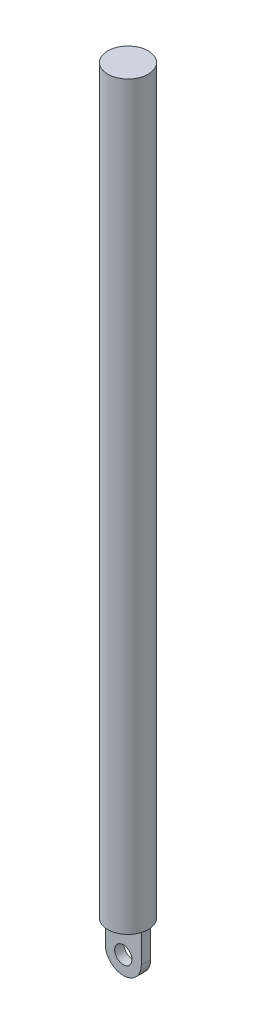
ISO-10303-21;
HEADER;
FILE_DESCRIPTION(('STEP AP214'),'2;1');
FILE_NAME('part.step','',(''),(''),'','','');
FILE_SCHEMA(('AUTOMOTIVE_DESIGN { 1 0 10303 214 1 1 1 1 }'));
ENDSEC;
DATA;
#1=APPLICATION_CONTEXT('core data for automotive mechanical design processes');
#2=APPLICATION_PROTOCOL_DEFINITION('international standard','automotive_design',2000,#1);
#3=PRODUCT_CONTEXT('',#1,'mechanical');
#4=PRODUCT('Part','Part','',(#3));
#5=PRODUCT_RELATED_PRODUCT_CATEGORY('part','',(#4));
#6=PRODUCT_DEFINITION_FORMATION('','',#4);
#7=PRODUCT_DEFINITION_CONTEXT('part definition',#1,'design');
#8=PRODUCT_DEFINITION('design','',#6,#7);
#9=PRODUCT_DEFINITION_SHAPE('','',#8);
#10=(LENGTH_UNIT() NAMED_UNIT(*) SI_UNIT(.MILLI.,.METRE.));
#11=(NAMED_UNIT(*) PLANE_ANGLE_UNIT() SI_UNIT($,.RADIAN.));
#12=(NAMED_UNIT(*) SI_UNIT($,.STERADIAN.) SOLID_ANGLE_UNIT());
#13=UNCERTAINTY_MEASURE_WITH_UNIT(LENGTH_MEASURE(1.E-05),#10,'distance_accuracy_value','');
#14=(GEOMETRIC_REPRESENTATION_CONTEXT(3) GLOBAL_UNCERTAINTY_ASSIGNED_CONTEXT((#13)) GLOBAL_UNIT_ASSIGNED_CONTEXT((#10,
#11,#12)) REPRESENTATION_CONTEXT('',''));
#15=CARTESIAN_POINT('',(0.,0.,0.));
#16=DIRECTION('',(0.,0.,1.));
#17=DIRECTION('',(1.,0.,0.));
#18=AXIS2_PLACEMENT_3D('',#15,#16,#17);
#19=CARTESIAN_POINT('',(0.,-7.98,-0.784999999999999));
#20=DIRECTION('',(0.,0.,-1.));
#21=DIRECTION('',(-1.,0.,0.));
#22=AXIS2_PLACEMENT_3D('',#19,#20,#21);
#23=PLANE('',#22);
#24=CARTESIAN_POINT('',(0.,-4.955,-0.784999999999999));
#25=DIRECTION('',(0.,0.,-1.));
#26=DIRECTION('',(-1.,0.,0.));
#27=AXIS2_PLACEMENT_3D('',#24,#25,#26);
#28=CIRCLE('',#27,1.45);
#29=CARTESIAN_POINT('',(-1.45,-4.955,-0.784999999999999));
#30=VERTEX_POINT('',#29);
#31=EDGE_CURVE('E133',#30,#30,#28,.T.);
#32=ORIENTED_EDGE('',*,*,#31,.F.);
#33=EDGE_LOOP('',(#32));
#34=FACE_BOUND('',#33,.T.);
#35=CARTESIAN_POINT('',(0.,-4.955,-0.784999999999999));
#36=DIRECTION('',(0.,0.,1.));
#37=DIRECTION('',(-1.,0.,0.));
#38=AXIS2_PLACEMENT_3D('',#35,#36,#37);
#39=CIRCLE('',#38,3.025);
#40=CARTESIAN_POINT('',(-3.025,-4.955,-0.784999999999998));
#41=VERTEX_POINT('',#40);
#42=CARTESIAN_POINT('',(3.025,-4.955,-0.785));
#43=VERTEX_POINT('',#42);
#44=EDGE_CURVE('E83',#41,#43,#39,.T.);
#45=ORIENTED_EDGE('',*,*,#44,.F.);
#46=DIRECTION('',(0.,1.,0.));
#47=VECTOR('',#46,1.);
#48=CARTESIAN_POINT('',(-3.025,-7.98,-0.784999999999998));
#49=LINE('',#48,#47);
#50=CARTESIAN_POINT('',(-3.025,0.,-0.784999999999998));
#51=VERTEX_POINT('',#50);
#52=EDGE_CURVE('E66',#41,#51,#49,.T.);
#53=ORIENTED_EDGE('',*,*,#52,.T.);
#54=DIRECTION('',(-1.,0.,0.));
#55=VECTOR('',#54,1.);
#56=CARTESIAN_POINT('',(0.,0.,-0.784999999999999));
#57=LINE('',#56,#55);
#58=CARTESIAN_POINT('',(3.025,0.,-0.785));
#59=VERTEX_POINT('',#58);
#60=EDGE_CURVE('E100',#59,#51,#57,.T.);
#61=ORIENTED_EDGE('',*,*,#60,.F.);
#62=DIRECTION('',(0.,1.,0.));
#63=VECTOR('',#62,1.);
#64=CARTESIAN_POINT('',(3.025,-7.98,-0.785));
#65=LINE('',#64,#63);
#66=EDGE_CURVE('E95',#43,#59,#65,.T.);
#67=ORIENTED_EDGE('',*,*,#66,.F.);
#68=EDGE_LOOP('',(#45,#53,#61,#67));
#69=FACE_BOUND('',#68,.T.);
#70=ADVANCED_FACE('F40',(#34,#69),#23,.T.);
#71=CARTESIAN_POINT('',(0.,-7.98,0.785000000000001));
#72=DIRECTION('',(0.,0.,-1.));
#73=DIRECTION('',(-1.,0.,0.));
#74=AXIS2_PLACEMENT_3D('',#71,#72,#73);
#75=PLANE('',#74);
#76=CARTESIAN_POINT('',(0.,-4.955,0.785000000000001));
#77=DIRECTION('',(0.,0.,-1.));
#78=DIRECTION('',(-1.,0.,0.));
#79=AXIS2_PLACEMENT_3D('',#76,#77,#78);
#80=CIRCLE('',#79,1.45);
#81=CARTESIAN_POINT('',(-1.45,-4.955,0.785000000000001));
#82=VERTEX_POINT('',#81);
#83=EDGE_CURVE('E44',#82,#82,#80,.T.);
#84=ORIENTED_EDGE('',*,*,#83,.T.);
#85=EDGE_LOOP('',(#84));
#86=FACE_BOUND('',#85,.T.);
#87=DIRECTION('',(0.,1.,0.));
#88=VECTOR('',#87,1.);
#89=CARTESIAN_POINT('',(-3.025,-7.98,0.785000000000002));
#90=LINE('',#89,#88);
#91=CARTESIAN_POINT('',(-3.025,-4.955,0.785000000000002));
#92=VERTEX_POINT('',#91);
#93=CARTESIAN_POINT('',(-3.025,0.,0.785000000000002));
#94=VERTEX_POINT('',#93);
#95=EDGE_CURVE('E106',#92,#94,#90,.T.);
#96=ORIENTED_EDGE('',*,*,#95,.F.);
#97=CARTESIAN_POINT('',(0.,-4.955,0.785000000000001));
#98=DIRECTION('',(0.,0.,-1.));
#99=DIRECTION('',(-1.,0.,0.));
#100=AXIS2_PLACEMENT_3D('',#97,#98,#99);
#101=CIRCLE('',#100,3.025);
#102=CARTESIAN_POINT('',(3.025,-4.955,0.785000000000002));
#103=VERTEX_POINT('',#102);
#104=EDGE_CURVE('E58',#92,#103,#101,.F.);
#105=ORIENTED_EDGE('',*,*,#104,.T.);
#106=DIRECTION('',(0.,1.,0.));
#107=VECTOR('',#106,1.);
#108=CARTESIAN_POINT('',(3.025,-7.98,0.785));
#109=LINE('',#108,#107);
#110=CARTESIAN_POINT('',(3.025,0.,0.785));
#111=VERTEX_POINT('',#110);
#112=EDGE_CURVE('E97',#103,#111,#109,.T.);
#113=ORIENTED_EDGE('',*,*,#112,.T.);
#114=DIRECTION('',(-1.,0.,0.));
#115=VECTOR('',#114,1.);
#116=CARTESIAN_POINT('',(0.,0.,0.785000000000001));
#117=LINE('',#116,#115);
#118=EDGE_CURVE('E116',#111,#94,#117,.T.);
#119=ORIENTED_EDGE('',*,*,#118,.T.);
#120=EDGE_LOOP('',(#96,#105,#113,#119));
#121=FACE_BOUND('',#120,.T.);
#122=ADVANCED_FACE('F142',(#86,#121),#75,.F.);
#123=CARTESIAN_POINT('',(0.,124.37,0.));
#124=DIRECTION('',(0.,-1.,0.));
#125=DIRECTION('',(0.,0.,-1.));
#126=AXIS2_PLACEMENT_3D('',#123,#124,#125);
#127=CYLINDRICAL_SURFACE('',#126,3.395);
#128=CARTESIAN_POINT('',(0.,124.37,0.));
#129=DIRECTION('',(0.,1.,0.));
#130=DIRECTION('',(0.,0.,1.));
#131=AXIS2_PLACEMENT_3D('',#128,#129,#130);
#132=CIRCLE('',#131,3.395);
#133=CARTESIAN_POINT('',(0.,124.37,3.395));
#134=VERTEX_POINT('',#133);
#135=EDGE_CURVE('E11',#134,#134,#132,.T.);
#136=ORIENTED_EDGE('',*,*,#135,.F.);
#137=EDGE_LOOP('',(#136));
#138=FACE_BOUND('',#137,.T.);
#139=CARTESIAN_POINT('',(0.,0.,0.));
#140=DIRECTION('',(0.,1.,0.));
#141=DIRECTION('',(0.,0.,1.));
#142=AXIS2_PLACEMENT_3D('',#139,#140,#141);
#143=CIRCLE('',#142,3.395);
#144=CARTESIAN_POINT('',(0.,0.,3.395));
#145=VERTEX_POINT('',#144);
#146=EDGE_CURVE('E50',#145,#145,#143,.T.);
#147=ORIENTED_EDGE('',*,*,#146,.T.);
#148=EDGE_LOOP('',(#147));
#149=FACE_BOUND('',#148,.T.);
#150=ADVANCED_FACE('F42',(#138,#149),#127,.T.);
#151=CARTESIAN_POINT('',(0.,124.37,0.));
#152=DIRECTION('',(0.,1.,0.));
#153=DIRECTION('',(0.,0.,1.));
#154=AXIS2_PLACEMENT_3D('',#151,#152,#153);
#155=PLANE('',#154);
#156=ORIENTED_EDGE('',*,*,#135,.T.);
#157=EDGE_LOOP('',(#156));
#158=FACE_BOUND('',#157,.T.);
#159=ADVANCED_FACE('F161',(#158),#155,.T.);
#160=CARTESIAN_POINT('',(0.,0.,0.));
#161=DIRECTION('',(0.,1.,0.));
#162=DIRECTION('',(0.,0.,1.));
#163=AXIS2_PLACEMENT_3D('',#160,#161,#162);
#164=PLANE('',#163);
#165=DIRECTION('',(0.,0.,1.));
#166=VECTOR('',#165,1.);
#167=CARTESIAN_POINT('',(3.025,0.,0.));
#168=LINE('',#167,#166);
#169=EDGE_CURVE('E109',#59,#111,#168,.T.);
#170=ORIENTED_EDGE('',*,*,#169,.F.);
#171=ORIENTED_EDGE('',*,*,#60,.T.);
#172=DIRECTION('',(0.,0.,1.));
#173=VECTOR('',#172,1.);
#174=CARTESIAN_POINT('',(-3.025,0.,0.));
#175=LINE('',#174,#173);
#176=EDGE_CURVE('E119',#51,#94,#175,.T.);
#177=ORIENTED_EDGE('',*,*,#176,.T.);
#178=ORIENTED_EDGE('',*,*,#118,.F.);
#179=EDGE_LOOP('',(#170,#171,#177,#178));
#180=FACE_BOUND('',#179,.T.);
#181=ORIENTED_EDGE('',*,*,#146,.F.);
#182=EDGE_LOOP('',(#181));
#183=FACE_BOUND('',#182,.T.);
#184=ADVANCED_FACE('F163',(#180,#183),#164,.F.);
#185=CARTESIAN_POINT('',(3.025,-7.98,0.));
#186=DIRECTION('',(-1.,0.,0.));
#187=DIRECTION('',(0.,0.,1.));
#188=AXIS2_PLACEMENT_3D('',#185,#186,#187);
#189=PLANE('',#188);
#190=ORIENTED_EDGE('',*,*,#112,.F.);
#191=DIRECTION('',(0.,0.,-1.));
#192=VECTOR('',#191,1.);
#193=CARTESIAN_POINT('',(3.025,-4.955,7.195));
#194=LINE('',#193,#192);
#195=EDGE_CURVE('E86',#103,#43,#194,.T.);
#196=ORIENTED_EDGE('',*,*,#195,.T.);
#197=ORIENTED_EDGE('',*,*,#66,.T.);
#198=ORIENTED_EDGE('',*,*,#169,.T.);
#199=EDGE_LOOP('',(#190,#196,#197,#198));
#200=FACE_BOUND('',#199,.T.);
#201=ADVANCED_FACE('F93',(#200),#189,.F.);
#202=CARTESIAN_POINT('',(-3.025,-7.98,0.));
#203=DIRECTION('',(-1.,0.,0.));
#204=DIRECTION('',(0.,0.,1.));
#205=AXIS2_PLACEMENT_3D('',#202,#203,#204);
#206=PLANE('',#205);
#207=DIRECTION('',(0.,0.,-1.));
#208=VECTOR('',#207,1.);
#209=CARTESIAN_POINT('',(-3.025,-4.955,7.195));
#210=LINE('',#209,#208);
#211=EDGE_CURVE('E88',#92,#41,#210,.T.);
#212=ORIENTED_EDGE('',*,*,#211,.F.);
#213=ORIENTED_EDGE('',*,*,#95,.T.);
#214=ORIENTED_EDGE('',*,*,#176,.F.);
#215=ORIENTED_EDGE('',*,*,#52,.F.);
#216=EDGE_LOOP('',(#212,#213,#214,#215));
#217=FACE_BOUND('',#216,.T.);
#218=ADVANCED_FACE('F150',(#217),#206,.T.);
#219=CARTESIAN_POINT('',(0.,-4.955,7.195));
#220=DIRECTION('',(0.,0.,-1.));
#221=DIRECTION('',(-1.,0.,0.));
#222=AXIS2_PLACEMENT_3D('',#219,#220,#221);
#223=CYLINDRICAL_SURFACE('',#222,3.025);
#224=ORIENTED_EDGE('',*,*,#211,.T.);
#225=ORIENTED_EDGE('',*,*,#44,.T.);
#226=ORIENTED_EDGE('',*,*,#195,.F.);
#227=ORIENTED_EDGE('',*,*,#104,.F.);
#228=EDGE_LOOP('',(#224,#225,#226,#227));
#229=FACE_BOUND('',#228,.T.);
#230=ADVANCED_FACE('F85',(#229),#223,.T.);
#231=CARTESIAN_POINT('',(0.,-4.955,7.195));
#232=DIRECTION('',(0.,0.,-1.));
#233=DIRECTION('',(-1.,0.,0.));
#234=AXIS2_PLACEMENT_3D('',#231,#232,#233);
#235=CYLINDRICAL_SURFACE('',#234,1.45);
#236=ORIENTED_EDGE('',*,*,#31,.T.);
#237=EDGE_LOOP('',(#236));
#238=FACE_BOUND('',#237,.T.);
#239=ORIENTED_EDGE('',*,*,#83,.F.);
#240=EDGE_LOOP('',(#239));
#241=FACE_BOUND('',#240,.T.);
#242=ADVANCED_FACE('F144',(#238,#241),#235,.F.);
#243=CLOSED_SHELL('',(#70,#122,#150,#159,#184,#201,#218,#230,#242));
#244=MANIFOLD_SOLID_BREP('B2',#243);
#245=ADVANCED_BREP_SHAPE_REPRESENTATION('',(#18,#244),#14);
#246=SHAPE_DEFINITION_REPRESENTATION(#9,#245);
ENDSEC;
END-ISO-10303-21;
